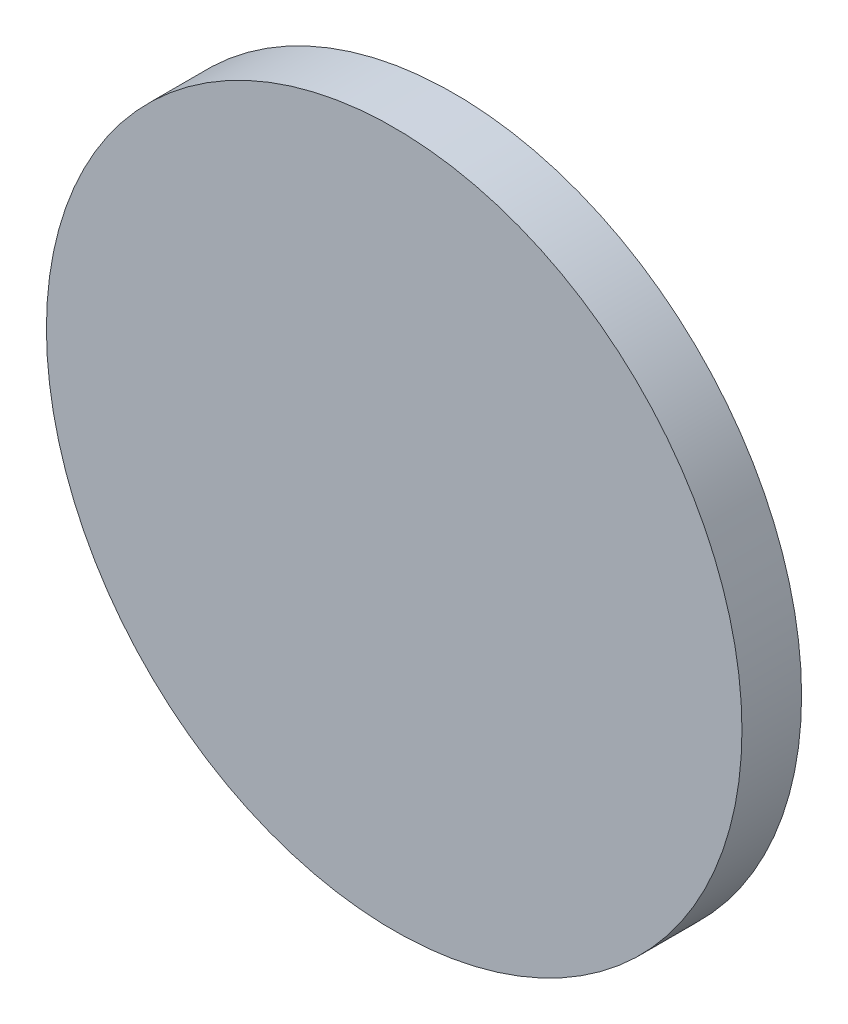
ISO-10303-21;
HEADER;
FILE_DESCRIPTION(('STEP AP214'),'2;1');
FILE_NAME('part.step','',(''),(''),'','','');
FILE_SCHEMA(('AUTOMOTIVE_DESIGN { 1 0 10303 214 1 1 1 1 }'));
ENDSEC;
DATA;
#1=APPLICATION_CONTEXT('core data for automotive mechanical design processes');
#2=APPLICATION_PROTOCOL_DEFINITION('international standard','automotive_design',2000,#1);
#3=PRODUCT_CONTEXT('',#1,'mechanical');
#4=PRODUCT('Part','Part','',(#3));
#5=PRODUCT_RELATED_PRODUCT_CATEGORY('part','',(#4));
#6=PRODUCT_DEFINITION_FORMATION('','',#4);
#7=PRODUCT_DEFINITION_CONTEXT('part definition',#1,'design');
#8=PRODUCT_DEFINITION('design','',#6,#7);
#9=PRODUCT_DEFINITION_SHAPE('','',#8);
#10=(LENGTH_UNIT() NAMED_UNIT(*) SI_UNIT(.MILLI.,.METRE.));
#11=(NAMED_UNIT(*) PLANE_ANGLE_UNIT() SI_UNIT($,.RADIAN.));
#12=(NAMED_UNIT(*) SI_UNIT($,.STERADIAN.) SOLID_ANGLE_UNIT());
#13=UNCERTAINTY_MEASURE_WITH_UNIT(LENGTH_MEASURE(1.E-05),#10,'distance_accuracy_value','');
#14=(GEOMETRIC_REPRESENTATION_CONTEXT(3) GLOBAL_UNCERTAINTY_ASSIGNED_CONTEXT((#13)) GLOBAL_UNIT_ASSIGNED_CONTEXT((#10,
#11,#12)) REPRESENTATION_CONTEXT('',''));
#15=CARTESIAN_POINT('',(0.,0.,0.));
#16=DIRECTION('',(0.,0.,1.));
#17=DIRECTION('',(1.,0.,0.));
#18=AXIS2_PLACEMENT_3D('',#15,#16,#17);
#19=CARTESIAN_POINT('',(1.72466,5.382260006176,0.79916));
#20=DIRECTION('',(0.,0.,1.));
#21=DIRECTION('',(1.,0.,0.));
#22=AXIS2_PLACEMENT_3D('',#19,#20,#21);
#23=PLANE('',#22);
#24=CARTESIAN_POINT('',(1.72466,5.382260006176,0.79916));
#25=DIRECTION('',(0.,0.,1.));
#26=DIRECTION('',(1.,0.,0.));
#27=AXIS2_PLACEMENT_3D('',#24,#25,#26);
#28=CIRCLE('',#27,0.200024667);
#29=CARTESIAN_POINT('',(1.924684667,5.382260006176,0.79916));
#30=VERTEX_POINT('',#29);
#31=EDGE_CURVE('E18',#30,#30,#28,.F.);
#32=ORIENTED_EDGE('',*,*,#31,.F.);
#33=EDGE_LOOP('',(#32));
#34=FACE_BOUND('',#33,.T.);
#35=ADVANCED_FACE('F15',(#34),#23,.T.);
#36=CARTESIAN_POINT('',(1.72466,5.382260006176,0.76487));
#37=DIRECTION('',(0.,0.,1.));
#38=DIRECTION('',(1.,0.,0.));
#39=AXIS2_PLACEMENT_3D('',#36,#37,#38);
#40=CYLINDRICAL_SURFACE('',#39,0.200024667);
#41=ORIENTED_EDGE('',*,*,#31,.T.);
#42=EDGE_LOOP('',(#41));
#43=FACE_BOUND('',#42,.T.);
#44=CARTESIAN_POINT('',(1.72466,5.382260006176,0.76487));
#45=DIRECTION('',(0.,0.,1.));
#46=DIRECTION('',(1.,0.,0.));
#47=AXIS2_PLACEMENT_3D('',#44,#45,#46);
#48=CIRCLE('',#47,0.200024667);
#49=CARTESIAN_POINT('',(1.924684667,5.382260006176,0.76487));
#50=VERTEX_POINT('',#49);
#51=EDGE_CURVE('E10',#50,#50,#48,.F.);
#52=ORIENTED_EDGE('',*,*,#51,.F.);
#53=EDGE_LOOP('',(#52));
#54=FACE_BOUND('',#53,.T.);
#55=ADVANCED_FACE('F27',(#43,#54),#40,.T.);
#56=CARTESIAN_POINT('',(1.72466,5.382260006176,0.76487));
#57=DIRECTION('',(0.,0.,-1.));
#58=DIRECTION('',(-1.,0.,0.));
#59=AXIS2_PLACEMENT_3D('',#56,#57,#58);
#60=PLANE('',#59);
#61=ORIENTED_EDGE('',*,*,#51,.T.);
#62=EDGE_LOOP('',(#61));
#63=FACE_BOUND('',#62,.T.);
#64=ADVANCED_FACE('F35',(#63),#60,.T.);
#65=CLOSED_SHELL('',(#35,#55,#64));
#66=MANIFOLD_SOLID_BREP('B1',#65);
#67=ADVANCED_BREP_SHAPE_REPRESENTATION('',(#18,#66),#14);
#68=SHAPE_DEFINITION_REPRESENTATION(#9,#67);
ENDSEC;
END-ISO-10303-21;
